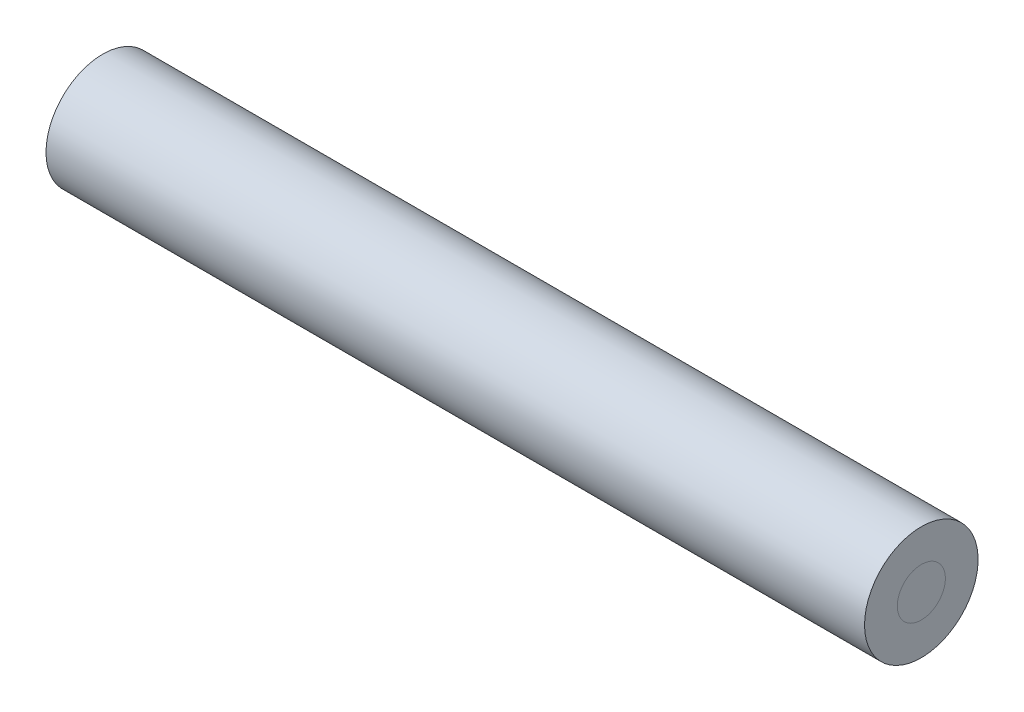
ISO-10303-21;
HEADER;
FILE_DESCRIPTION(('STEP AP214'),'2;1');
FILE_NAME('part.step','',(''),(''),'','','');
FILE_SCHEMA(('AUTOMOTIVE_DESIGN { 1 0 10303 214 1 1 1 1 }'));
ENDSEC;
DATA;
#1=APPLICATION_CONTEXT('core data for automotive mechanical design processes');
#2=APPLICATION_PROTOCOL_DEFINITION('international standard','automotive_design',2000,#1);
#3=PRODUCT_CONTEXT('',#1,'mechanical');
#4=PRODUCT('Part','Part','',(#3));
#5=PRODUCT_RELATED_PRODUCT_CATEGORY('part','',(#4));
#6=PRODUCT_DEFINITION_FORMATION('','',#4);
#7=PRODUCT_DEFINITION_CONTEXT('part definition',#1,'design');
#8=PRODUCT_DEFINITION('design','',#6,#7);
#9=PRODUCT_DEFINITION_SHAPE('','',#8);
#10=(LENGTH_UNIT() NAMED_UNIT(*) SI_UNIT(.MILLI.,.METRE.));
#11=(NAMED_UNIT(*) PLANE_ANGLE_UNIT() SI_UNIT($,.RADIAN.));
#12=(NAMED_UNIT(*) SI_UNIT($,.STERADIAN.) SOLID_ANGLE_UNIT());
#13=UNCERTAINTY_MEASURE_WITH_UNIT(LENGTH_MEASURE(1.E-05),#10,'distance_accuracy_value','');
#14=(GEOMETRIC_REPRESENTATION_CONTEXT(3) GLOBAL_UNCERTAINTY_ASSIGNED_CONTEXT((#13)) GLOBAL_UNIT_ASSIGNED_CONTEXT((#10,
#11,#12)) REPRESENTATION_CONTEXT('',''));
#15=CARTESIAN_POINT('',(0.,0.,0.));
#16=DIRECTION('',(0.,0.,1.));
#17=DIRECTION('',(1.,0.,0.));
#18=AXIS2_PLACEMENT_3D('',#15,#16,#17);
#19=CARTESIAN_POINT('',(-23.634620275434,54.5748086768175,5.55882540789796));
#20=DIRECTION('',(1.,0.,0.));
#21=DIRECTION('',(0.,0.,-1.));
#22=AXIS2_PLACEMENT_3D('',#19,#20,#21);
#23=CYLINDRICAL_SURFACE('',#22,0.596900000000003);
#24=CARTESIAN_POINT('',(-23.634620275434,54.5748086768175,5.55882540789796));
#25=DIRECTION('',(-1.,0.,0.));
#26=DIRECTION('',(0.,0.,1.));
#27=AXIS2_PLACEMENT_3D('',#24,#25,#26);
#28=CIRCLE('',#27,0.596900000000003);
#29=CARTESIAN_POINT('',(-23.634620275434,54.5748086768175,6.15572540789797));
#30=VERTEX_POINT('',#29);
#31=EDGE_CURVE('E60',#30,#30,#28,.T.);
#32=ORIENTED_EDGE('',*,*,#31,.T.);
#33=EDGE_LOOP('',(#32));
#34=FACE_BOUND('',#33,.T.);
#35=CARTESIAN_POINT('',(-3.31462027543403,54.5748086768175,5.55882540789798));
#36=DIRECTION('',(-1.,0.,0.));
#37=DIRECTION('',(0.,0.,1.));
#38=AXIS2_PLACEMENT_3D('',#35,#36,#37);
#39=CIRCLE('',#38,0.596900000000003);
#40=CARTESIAN_POINT('',(-3.31462027543403,54.5748086768175,6.15572540789799));
#41=VERTEX_POINT('',#40);
#42=EDGE_CURVE('E66',#41,#41,#39,.T.);
#43=ORIENTED_EDGE('',*,*,#42,.F.);
#44=EDGE_LOOP('',(#43));
#45=FACE_BOUND('',#44,.T.);
#46=ADVANCED_FACE('F53',(#34,#45),#23,.F.);
#47=CARTESIAN_POINT('',(-23.634620275434,54.5748086768175,5.55882540789796));
#48=DIRECTION('',(1.,0.,0.));
#49=DIRECTION('',(0.,0.,-1.));
#50=AXIS2_PLACEMENT_3D('',#47,#48,#49);
#51=CYLINDRICAL_SURFACE('',#50,1.4097);
#52=CARTESIAN_POINT('',(-23.634620275434,54.5748086768175,5.55882540789796));
#53=DIRECTION('',(-1.,0.,0.));
#54=DIRECTION('',(0.,0.,1.));
#55=AXIS2_PLACEMENT_3D('',#52,#53,#54);
#56=CIRCLE('',#55,1.4097);
#57=CARTESIAN_POINT('',(-23.634620275434,54.5748086768175,6.96852540789796));
#58=VERTEX_POINT('',#57);
#59=EDGE_CURVE('E11',#58,#58,#56,.T.);
#60=ORIENTED_EDGE('',*,*,#59,.F.);
#61=EDGE_LOOP('',(#60));
#62=FACE_BOUND('',#61,.T.);
#63=CARTESIAN_POINT('',(-3.31462027543403,54.5748086768175,5.55882540789798));
#64=DIRECTION('',(-1.,0.,0.));
#65=DIRECTION('',(0.,0.,1.));
#66=AXIS2_PLACEMENT_3D('',#63,#64,#65);
#67=CIRCLE('',#66,1.4097);
#68=CARTESIAN_POINT('',(-3.31462027543403,54.5748086768175,6.96852540789798));
#69=VERTEX_POINT('',#68);
#70=EDGE_CURVE('E56',#69,#69,#67,.T.);
#71=ORIENTED_EDGE('',*,*,#70,.T.);
#72=EDGE_LOOP('',(#71));
#73=FACE_BOUND('',#72,.T.);
#74=ADVANCED_FACE('F73',(#62,#73),#51,.T.);
#75=CARTESIAN_POINT('',(-23.634620275434,0.,0.));
#76=DIRECTION('',(-1.,0.,0.));
#77=DIRECTION('',(0.,0.,1.));
#78=AXIS2_PLACEMENT_3D('',#75,#76,#77);
#79=PLANE('',#78);
#80=ORIENTED_EDGE('',*,*,#31,.F.);
#81=EDGE_LOOP('',(#80));
#82=FACE_BOUND('',#81,.T.);
#83=ORIENTED_EDGE('',*,*,#59,.T.);
#84=EDGE_LOOP('',(#83));
#85=FACE_BOUND('',#84,.T.);
#86=ADVANCED_FACE('F77',(#82,#85),#79,.T.);
#87=CARTESIAN_POINT('',(-3.31462027543397,0.,0.));
#88=DIRECTION('',(-1.,0.,0.));
#89=DIRECTION('',(0.,0.,1.));
#90=AXIS2_PLACEMENT_3D('',#87,#88,#89);
#91=PLANE('',#90);
#92=ORIENTED_EDGE('',*,*,#42,.T.);
#93=EDGE_LOOP('',(#92));
#94=FACE_BOUND('',#93,.T.);
#95=ORIENTED_EDGE('',*,*,#70,.F.);
#96=EDGE_LOOP('',(#95));
#97=FACE_BOUND('',#96,.T.);
#98=ADVANCED_FACE('F75',(#94,#97),#91,.F.);
#99=CLOSED_SHELL('',(#46,#74,#86,#98));
#100=MANIFOLD_SOLID_BREP('B2',#99);
#101=CARTESIAN_POINT('',(-23.634620275434,54.5748086768175,5.55882540789796));
#102=DIRECTION('',(1.,0.,0.));
#103=DIRECTION('',(0.,0.,-1.));
#104=AXIS2_PLACEMENT_3D('',#101,#102,#103);
#105=CYLINDRICAL_SURFACE('',#104,0.596900000000003);
#106=CARTESIAN_POINT('',(-23.634620275434,54.5748086768175,5.55882540789796));
#107=DIRECTION('',(-1.,0.,0.));
#108=DIRECTION('',(0.,0.,1.));
#109=AXIS2_PLACEMENT_3D('',#106,#107,#108);
#110=CIRCLE('',#109,0.596900000000003);
#111=CARTESIAN_POINT('',(-23.634620275434,54.5748086768175,6.15572540789797));
#112=VERTEX_POINT('',#111);
#113=EDGE_CURVE('E52',#112,#112,#110,.T.);
#114=ORIENTED_EDGE('',*,*,#113,.F.);
#115=EDGE_LOOP('',(#114));
#116=FACE_BOUND('',#115,.T.);
#117=CARTESIAN_POINT('',(-3.31462027543403,54.5748086768175,5.55882540789798));
#118=DIRECTION('',(-1.,0.,0.));
#119=DIRECTION('',(0.,0.,1.));
#120=AXIS2_PLACEMENT_3D('',#117,#118,#119);
#121=CIRCLE('',#120,0.596900000000003);
#122=CARTESIAN_POINT('',(-3.31462027543403,54.5748086768175,6.15572540789799));
#123=VERTEX_POINT('',#122);
#124=EDGE_CURVE('E134',#123,#123,#121,.T.);
#125=ORIENTED_EDGE('',*,*,#124,.T.);
#126=EDGE_LOOP('',(#125));
#127=FACE_BOUND('',#126,.T.);
#128=ADVANCED_FACE('F131',(#116,#127),#105,.T.);
#129=CARTESIAN_POINT('',(-23.634620275434,0.,0.));
#130=DIRECTION('',(-1.,0.,0.));
#131=DIRECTION('',(0.,0.,1.));
#132=AXIS2_PLACEMENT_3D('',#129,#130,#131);
#133=PLANE('',#132);
#134=ORIENTED_EDGE('',*,*,#113,.T.);
#135=EDGE_LOOP('',(#134));
#136=FACE_BOUND('',#135,.T.);
#137=ADVANCED_FACE('F146',(#136),#133,.T.);
#138=CARTESIAN_POINT('',(-3.31462027543397,0.,0.));
#139=DIRECTION('',(-1.,0.,0.));
#140=DIRECTION('',(0.,0.,1.));
#141=AXIS2_PLACEMENT_3D('',#138,#139,#140);
#142=PLANE('',#141);
#143=ORIENTED_EDGE('',*,*,#124,.F.);
#144=EDGE_LOOP('',(#143));
#145=FACE_BOUND('',#144,.T.);
#146=ADVANCED_FACE('F144',(#145),#142,.F.);
#147=CLOSED_SHELL('',(#128,#137,#146));
#148=MANIFOLD_SOLID_BREP('B6',#147);
#149=ADVANCED_BREP_SHAPE_REPRESENTATION('',(#18,#100,#148),#14);
#150=SHAPE_DEFINITION_REPRESENTATION(#9,#149);
ENDSEC;
END-ISO-10303-21;
